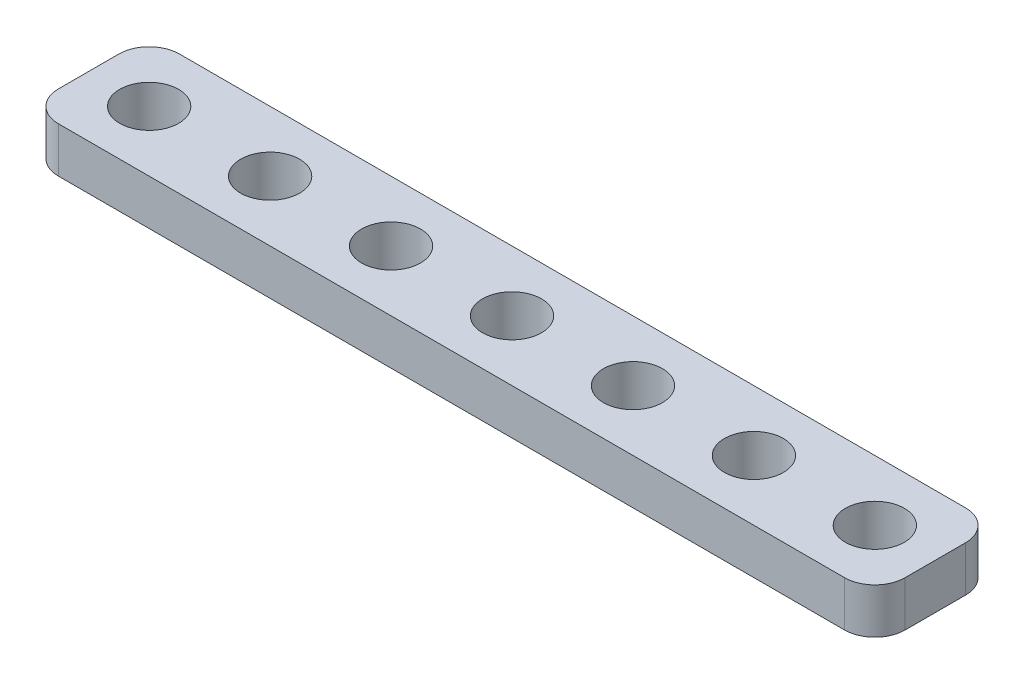
ISO-10303-21;
HEADER;
FILE_DESCRIPTION(('STEP AP214'),'2;1');
FILE_NAME('part.step','',(''),(''),'','','');
FILE_SCHEMA(('AUTOMOTIVE_DESIGN { 1 0 10303 214 1 1 1 1 }'));
ENDSEC;
DATA;
#1=APPLICATION_CONTEXT('core data for automotive mechanical design processes');
#2=APPLICATION_PROTOCOL_DEFINITION('international standard','automotive_design',2000,#1);
#3=PRODUCT_CONTEXT('',#1,'mechanical');
#4=PRODUCT('Part','Part','',(#3));
#5=PRODUCT_RELATED_PRODUCT_CATEGORY('part','',(#4));
#6=PRODUCT_DEFINITION_FORMATION('','',#4);
#7=PRODUCT_DEFINITION_CONTEXT('part definition',#1,'design');
#8=PRODUCT_DEFINITION('design','',#6,#7);
#9=PRODUCT_DEFINITION_SHAPE('','',#8);
#10=(LENGTH_UNIT() NAMED_UNIT(*) SI_UNIT(.MILLI.,.METRE.));
#11=(NAMED_UNIT(*) PLANE_ANGLE_UNIT() SI_UNIT($,.RADIAN.));
#12=(NAMED_UNIT(*) SI_UNIT($,.STERADIAN.) SOLID_ANGLE_UNIT());
#13=UNCERTAINTY_MEASURE_WITH_UNIT(LENGTH_MEASURE(1.E-05),#10,'distance_accuracy_value','');
#14=(GEOMETRIC_REPRESENTATION_CONTEXT(3) GLOBAL_UNCERTAINTY_ASSIGNED_CONTEXT((#13)) GLOBAL_UNIT_ASSIGNED_CONTEXT((#10,
#11,#12)) REPRESENTATION_CONTEXT('',''));
#15=CARTESIAN_POINT('',(0.,0.,0.));
#16=DIRECTION('',(0.,0.,1.));
#17=DIRECTION('',(1.,0.,0.));
#18=AXIS2_PLACEMENT_3D('',#15,#16,#17);
#19=CARTESIAN_POINT('',(54.,3.,6.));
#20=DIRECTION('',(0.,-1.,0.));
#21=DIRECTION('',(0.,0.,-1.));
#22=AXIS2_PLACEMENT_3D('',#19,#20,#21);
#23=CYLINDRICAL_SURFACE('',#22,2.);
#24=CARTESIAN_POINT('',(54.,0.,6.));
#25=DIRECTION('',(0.,1.,0.));
#26=DIRECTION('',(0.,0.,1.));
#27=AXIS2_PLACEMENT_3D('',#24,#25,#26);
#28=CIRCLE('',#27,2.);
#29=CARTESIAN_POINT('',(54.,0.,8.));
#30=VERTEX_POINT('',#29);
#31=CARTESIAN_POINT('',(56.,0.,6.));
#32=VERTEX_POINT('',#31);
#33=EDGE_CURVE('E128',#30,#32,#28,.T.);
#34=ORIENTED_EDGE('',*,*,#33,.T.);
#35=DIRECTION('',(0.,-1.,0.));
#36=VECTOR('',#35,1.);
#37=CARTESIAN_POINT('',(56.,3.,6.));
#38=LINE('',#37,#36);
#39=CARTESIAN_POINT('',(56.,3.,6.));
#40=VERTEX_POINT('',#39);
#41=EDGE_CURVE('E11',#40,#32,#38,.T.);
#42=ORIENTED_EDGE('',*,*,#41,.F.);
#43=CARTESIAN_POINT('',(54.,3.,6.));
#44=DIRECTION('',(0.,1.,0.));
#45=DIRECTION('',(0.,0.,1.));
#46=AXIS2_PLACEMENT_3D('',#43,#44,#45);
#47=CIRCLE('',#46,2.);
#48=CARTESIAN_POINT('',(54.,3.,8.));
#49=VERTEX_POINT('',#48);
#50=EDGE_CURVE('E143',#49,#40,#47,.T.);
#51=ORIENTED_EDGE('',*,*,#50,.F.);
#52=DIRECTION('',(0.,-1.,0.));
#53=VECTOR('',#52,1.);
#54=CARTESIAN_POINT('',(54.,3.,8.));
#55=LINE('',#54,#53);
#56=EDGE_CURVE('E124',#49,#30,#55,.T.);
#57=ORIENTED_EDGE('',*,*,#56,.T.);
#58=EDGE_LOOP('',(#34,#42,#51,#57));
#59=FACE_BOUND('',#58,.T.);
#60=ADVANCED_FACE('F32',(#59),#23,.T.);
#61=CARTESIAN_POINT('',(56.,3.,2.));
#62=DIRECTION('',(-1.,0.,0.));
#63=DIRECTION('',(0.,0.,1.));
#64=AXIS2_PLACEMENT_3D('',#61,#62,#63);
#65=PLANE('',#64);
#66=DIRECTION('',(0.,0.,-1.));
#67=VECTOR('',#66,1.);
#68=CARTESIAN_POINT('',(56.,0.,2.));
#69=LINE('',#68,#67);
#70=CARTESIAN_POINT('',(56.,0.,2.));
#71=VERTEX_POINT('',#70);
#72=EDGE_CURVE('E131',#32,#71,#69,.T.);
#73=ORIENTED_EDGE('',*,*,#72,.T.);
#74=DIRECTION('',(0.,-1.,0.));
#75=VECTOR('',#74,1.);
#76=CARTESIAN_POINT('',(56.,3.,2.));
#77=LINE('',#76,#75);
#78=CARTESIAN_POINT('',(56.,3.,2.));
#79=VERTEX_POINT('',#78);
#80=EDGE_CURVE('E40',#79,#71,#77,.T.);
#81=ORIENTED_EDGE('',*,*,#80,.F.);
#82=DIRECTION('',(0.,0.,-1.));
#83=VECTOR('',#82,1.);
#84=CARTESIAN_POINT('',(56.,3.,2.));
#85=LINE('',#84,#83);
#86=EDGE_CURVE('E91',#40,#79,#85,.T.);
#87=ORIENTED_EDGE('',*,*,#86,.F.);
#88=ORIENTED_EDGE('',*,*,#41,.T.);
#89=EDGE_LOOP('',(#73,#81,#87,#88));
#90=FACE_BOUND('',#89,.T.);
#91=ADVANCED_FACE('F259',(#90),#65,.F.);
#92=CARTESIAN_POINT('',(54.,3.,2.));
#93=DIRECTION('',(0.,-1.,0.));
#94=DIRECTION('',(0.,0.,-1.));
#95=AXIS2_PLACEMENT_3D('',#92,#93,#94);
#96=CYLINDRICAL_SURFACE('',#95,2.);
#97=CARTESIAN_POINT('',(54.,0.,2.));
#98=DIRECTION('',(0.,1.,0.));
#99=DIRECTION('',(0.,0.,-1.));
#100=AXIS2_PLACEMENT_3D('',#97,#98,#99);
#101=CIRCLE('',#100,2.);
#102=CARTESIAN_POINT('',(54.,0.,0.));
#103=VERTEX_POINT('',#102);
#104=EDGE_CURVE('E134',#71,#103,#101,.T.);
#105=ORIENTED_EDGE('',*,*,#104,.T.);
#106=DIRECTION('',(0.,-1.,0.));
#107=VECTOR('',#106,1.);
#108=CARTESIAN_POINT('',(54.,3.,0.));
#109=LINE('',#108,#107);
#110=CARTESIAN_POINT('',(54.,3.,0.));
#111=VERTEX_POINT('',#110);
#112=EDGE_CURVE('E150',#111,#103,#109,.T.);
#113=ORIENTED_EDGE('',*,*,#112,.F.);
#114=CARTESIAN_POINT('',(54.,3.,2.));
#115=DIRECTION('',(0.,1.,0.));
#116=DIRECTION('',(0.,0.,-1.));
#117=AXIS2_PLACEMENT_3D('',#114,#115,#116);
#118=CIRCLE('',#117,2.);
#119=EDGE_CURVE('E158',#79,#111,#118,.T.);
#120=ORIENTED_EDGE('',*,*,#119,.F.);
#121=ORIENTED_EDGE('',*,*,#80,.T.);
#122=EDGE_LOOP('',(#105,#113,#120,#121));
#123=FACE_BOUND('',#122,.T.);
#124=ADVANCED_FACE('F156',(#123),#96,.T.);
#125=CARTESIAN_POINT('',(2.00000000000001,3.,0.));
#126=DIRECTION('',(0.,0.,1.));
#127=DIRECTION('',(1.,0.,0.));
#128=AXIS2_PLACEMENT_3D('',#125,#126,#127);
#129=PLANE('',#128);
#130=DIRECTION('',(-1.,0.,0.));
#131=VECTOR('',#130,1.);
#132=CARTESIAN_POINT('',(2.00000000000001,0.,0.));
#133=LINE('',#132,#131);
#134=CARTESIAN_POINT('',(2.00000000000001,0.,0.));
#135=VERTEX_POINT('',#134);
#136=EDGE_CURVE('E136',#103,#135,#133,.T.);
#137=ORIENTED_EDGE('',*,*,#136,.T.);
#138=DIRECTION('',(0.,-1.,0.));
#139=VECTOR('',#138,1.);
#140=CARTESIAN_POINT('',(2.00000000000001,3.,0.));
#141=LINE('',#140,#139);
#142=CARTESIAN_POINT('',(2.00000000000001,3.,0.));
#143=VERTEX_POINT('',#142);
#144=EDGE_CURVE('E147',#143,#135,#141,.T.);
#145=ORIENTED_EDGE('',*,*,#144,.F.);
#146=DIRECTION('',(-1.,0.,0.));
#147=VECTOR('',#146,1.);
#148=CARTESIAN_POINT('',(2.00000000000001,3.,0.));
#149=LINE('',#148,#147);
#150=EDGE_CURVE('E170',#111,#143,#149,.T.);
#151=ORIENTED_EDGE('',*,*,#150,.F.);
#152=ORIENTED_EDGE('',*,*,#112,.T.);
#153=EDGE_LOOP('',(#137,#145,#151,#152));
#154=FACE_BOUND('',#153,.T.);
#155=ADVANCED_FACE('F166',(#154),#129,.F.);
#156=CARTESIAN_POINT('',(2.,3.,2.));
#157=DIRECTION('',(0.,-1.,0.));
#158=DIRECTION('',(0.,0.,-1.));
#159=AXIS2_PLACEMENT_3D('',#156,#157,#158);
#160=CYLINDRICAL_SURFACE('',#159,2.);
#161=CARTESIAN_POINT('',(2.,0.,2.));
#162=DIRECTION('',(0.,1.,0.));
#163=DIRECTION('',(0.,0.,1.));
#164=AXIS2_PLACEMENT_3D('',#161,#162,#163);
#165=CIRCLE('',#164,2.);
#166=CARTESIAN_POINT('',(0.,0.,2.00000000000001));
#167=VERTEX_POINT('',#166);
#168=EDGE_CURVE('E138',#135,#167,#165,.T.);
#169=ORIENTED_EDGE('',*,*,#168,.T.);
#170=DIRECTION('',(0.,-1.,0.));
#171=VECTOR('',#170,1.);
#172=CARTESIAN_POINT('',(0.,3.,2.00000000000001));
#173=LINE('',#172,#171);
#174=CARTESIAN_POINT('',(0.,3.,2.00000000000001));
#175=VERTEX_POINT('',#174);
#176=EDGE_CURVE('E119',#175,#167,#173,.T.);
#177=ORIENTED_EDGE('',*,*,#176,.F.);
#178=CARTESIAN_POINT('',(2.,3.,2.));
#179=DIRECTION('',(0.,1.,0.));
#180=DIRECTION('',(0.,0.,1.));
#181=AXIS2_PLACEMENT_3D('',#178,#179,#180);
#182=CIRCLE('',#181,2.);
#183=EDGE_CURVE('E110',#143,#175,#182,.T.);
#184=ORIENTED_EDGE('',*,*,#183,.F.);
#185=ORIENTED_EDGE('',*,*,#144,.T.);
#186=EDGE_LOOP('',(#169,#177,#184,#185));
#187=FACE_BOUND('',#186,.T.);
#188=ADVANCED_FACE('F169',(#187),#160,.T.);
#189=CARTESIAN_POINT('',(0.,3.,2.00000000000001));
#190=DIRECTION('',(1.,0.,0.));
#191=DIRECTION('',(0.,0.,-1.));
#192=AXIS2_PLACEMENT_3D('',#189,#190,#191);
#193=PLANE('',#192);
#194=DIRECTION('',(0.,0.,1.));
#195=VECTOR('',#194,1.);
#196=CARTESIAN_POINT('',(0.,0.,2.00000000000001));
#197=LINE('',#196,#195);
#198=CARTESIAN_POINT('',(0.,0.,6.));
#199=VERTEX_POINT('',#198);
#200=EDGE_CURVE('E118',#167,#199,#197,.T.);
#201=ORIENTED_EDGE('',*,*,#200,.T.);
#202=DIRECTION('',(0.,-1.,0.));
#203=VECTOR('',#202,1.);
#204=CARTESIAN_POINT('',(0.,3.,6.));
#205=LINE('',#204,#203);
#206=CARTESIAN_POINT('',(0.,3.,6.));
#207=VERTEX_POINT('',#206);
#208=EDGE_CURVE('E115',#207,#199,#205,.T.);
#209=ORIENTED_EDGE('',*,*,#208,.F.);
#210=DIRECTION('',(0.,0.,1.));
#211=VECTOR('',#210,1.);
#212=CARTESIAN_POINT('',(0.,3.,2.00000000000001));
#213=LINE('',#212,#211);
#214=EDGE_CURVE('E104',#175,#207,#213,.T.);
#215=ORIENTED_EDGE('',*,*,#214,.F.);
#216=ORIENTED_EDGE('',*,*,#176,.T.);
#217=EDGE_LOOP('',(#201,#209,#215,#216));
#218=FACE_BOUND('',#217,.T.);
#219=ADVANCED_FACE('F116',(#218),#193,.F.);
#220=CARTESIAN_POINT('',(2.,3.,6.));
#221=DIRECTION('',(0.,-1.,0.));
#222=DIRECTION('',(0.,0.,-1.));
#223=AXIS2_PLACEMENT_3D('',#220,#221,#222);
#224=CYLINDRICAL_SURFACE('',#223,2.);
#225=CARTESIAN_POINT('',(2.,0.,6.));
#226=DIRECTION('',(0.,1.,0.));
#227=DIRECTION('',(0.,0.,1.));
#228=AXIS2_PLACEMENT_3D('',#225,#226,#227);
#229=CIRCLE('',#228,2.);
#230=CARTESIAN_POINT('',(2.,0.,8.));
#231=VERTEX_POINT('',#230);
#232=EDGE_CURVE('E77',#199,#231,#229,.T.);
#233=ORIENTED_EDGE('',*,*,#232,.T.);
#234=DIRECTION('',(0.,-1.,0.));
#235=VECTOR('',#234,1.);
#236=CARTESIAN_POINT('',(2.,3.,8.));
#237=LINE('',#236,#235);
#238=CARTESIAN_POINT('',(2.,3.,8.));
#239=VERTEX_POINT('',#238);
#240=EDGE_CURVE('E120',#239,#231,#237,.T.);
#241=ORIENTED_EDGE('',*,*,#240,.F.);
#242=CARTESIAN_POINT('',(2.,3.,6.));
#243=DIRECTION('',(0.,1.,0.));
#244=DIRECTION('',(0.,0.,1.));
#245=AXIS2_PLACEMENT_3D('',#242,#243,#244);
#246=CIRCLE('',#245,2.);
#247=EDGE_CURVE('E108',#207,#239,#246,.T.);
#248=ORIENTED_EDGE('',*,*,#247,.F.);
#249=ORIENTED_EDGE('',*,*,#208,.T.);
#250=EDGE_LOOP('',(#233,#241,#248,#249));
#251=FACE_BOUND('',#250,.T.);
#252=ADVANCED_FACE('F122',(#251),#224,.T.);
#253=CARTESIAN_POINT('',(2.,3.,8.));
#254=DIRECTION('',(0.,0.,-1.));
#255=DIRECTION('',(-1.,0.,0.));
#256=AXIS2_PLACEMENT_3D('',#253,#254,#255);
#257=PLANE('',#256);
#258=DIRECTION('',(1.,0.,0.));
#259=VECTOR('',#258,1.);
#260=CARTESIAN_POINT('',(2.,0.,8.));
#261=LINE('',#260,#259);
#262=EDGE_CURVE('E83',#231,#30,#261,.T.);
#263=ORIENTED_EDGE('',*,*,#262,.T.);
#264=ORIENTED_EDGE('',*,*,#56,.F.);
#265=DIRECTION('',(1.,0.,0.));
#266=VECTOR('',#265,1.);
#267=CARTESIAN_POINT('',(2.,3.,8.));
#268=LINE('',#267,#266);
#269=EDGE_CURVE('E48',#239,#49,#268,.T.);
#270=ORIENTED_EDGE('',*,*,#269,.F.);
#271=ORIENTED_EDGE('',*,*,#240,.T.);
#272=EDGE_LOOP('',(#263,#264,#270,#271));
#273=FACE_BOUND('',#272,.T.);
#274=ADVANCED_FACE('F229',(#273),#257,.F.);
#275=CARTESIAN_POINT('',(54.,3.,6.));
#276=DIRECTION('',(0.,1.,0.));
#277=DIRECTION('',(0.,0.,1.));
#278=AXIS2_PLACEMENT_3D('',#275,#276,#277);
#279=PLANE('',#278);
#280=CARTESIAN_POINT('',(52.,3.,4.));
#281=DIRECTION('',(0.,1.,0.));
#282=DIRECTION('',(0.,0.,1.));
#283=AXIS2_PLACEMENT_3D('',#280,#281,#282);
#284=CIRCLE('',#283,1.95);
#285=CARTESIAN_POINT('',(52.,3.,5.95));
#286=VERTEX_POINT('',#285);
#287=EDGE_CURVE('E183',#286,#286,#284,.T.);
#288=ORIENTED_EDGE('',*,*,#287,.F.);
#289=EDGE_LOOP('',(#288));
#290=FACE_BOUND('',#289,.T.);
#291=CARTESIAN_POINT('',(36.,3.,4.));
#292=DIRECTION('',(0.,1.,0.));
#293=DIRECTION('',(0.,0.,1.));
#294=AXIS2_PLACEMENT_3D('',#291,#292,#293);
#295=CIRCLE('',#294,1.95);
#296=CARTESIAN_POINT('',(36.,3.,5.95));
#297=VERTEX_POINT('',#296);
#298=EDGE_CURVE('E190',#297,#297,#295,.T.);
#299=ORIENTED_EDGE('',*,*,#298,.F.);
#300=EDGE_LOOP('',(#299));
#301=FACE_BOUND('',#300,.T.);
#302=CARTESIAN_POINT('',(28.,3.,4.));
#303=DIRECTION('',(0.,1.,0.));
#304=DIRECTION('',(0.,0.,1.));
#305=AXIS2_PLACEMENT_3D('',#302,#303,#304);
#306=CIRCLE('',#305,1.95000000000001);
#307=CARTESIAN_POINT('',(28.,3.,5.95000000000002));
#308=VERTEX_POINT('',#307);
#309=EDGE_CURVE('E196',#308,#308,#306,.T.);
#310=ORIENTED_EDGE('',*,*,#309,.F.);
#311=EDGE_LOOP('',(#310));
#312=FACE_BOUND('',#311,.T.);
#313=CARTESIAN_POINT('',(20.,3.,4.));
#314=DIRECTION('',(0.,1.,0.));
#315=DIRECTION('',(0.,0.,1.));
#316=AXIS2_PLACEMENT_3D('',#313,#314,#315);
#317=CIRCLE('',#316,1.95);
#318=CARTESIAN_POINT('',(20.,3.,5.95));
#319=VERTEX_POINT('',#318);
#320=EDGE_CURVE('E202',#319,#319,#317,.T.);
#321=ORIENTED_EDGE('',*,*,#320,.F.);
#322=EDGE_LOOP('',(#321));
#323=FACE_BOUND('',#322,.T.);
#324=CARTESIAN_POINT('',(12.,3.,4.00000000000001));
#325=DIRECTION('',(0.,1.,0.));
#326=DIRECTION('',(0.,0.,1.));
#327=AXIS2_PLACEMENT_3D('',#324,#325,#326);
#328=CIRCLE('',#327,1.95);
#329=CARTESIAN_POINT('',(12.,3.,5.95));
#330=VERTEX_POINT('',#329);
#331=EDGE_CURVE('E208',#330,#330,#328,.T.);
#332=ORIENTED_EDGE('',*,*,#331,.F.);
#333=EDGE_LOOP('',(#332));
#334=FACE_BOUND('',#333,.T.);
#335=CARTESIAN_POINT('',(44.,3.,4.));
#336=DIRECTION('',(0.,1.,0.));
#337=DIRECTION('',(0.,0.,1.));
#338=AXIS2_PLACEMENT_3D('',#335,#336,#337);
#339=CIRCLE('',#338,1.95);
#340=CARTESIAN_POINT('',(44.,3.,5.95));
#341=VERTEX_POINT('',#340);
#342=EDGE_CURVE('E176',#341,#341,#339,.T.);
#343=ORIENTED_EDGE('',*,*,#342,.F.);
#344=EDGE_LOOP('',(#343));
#345=FACE_BOUND('',#344,.T.);
#346=CARTESIAN_POINT('',(4.,3.,4.00000000000001));
#347=DIRECTION('',(0.,1.,0.));
#348=DIRECTION('',(0.,0.,1.));
#349=AXIS2_PLACEMENT_3D('',#346,#347,#348);
#350=CIRCLE('',#349,1.95);
#351=CARTESIAN_POINT('',(4.,3.,5.95));
#352=VERTEX_POINT('',#351);
#353=EDGE_CURVE('E184',#352,#352,#350,.T.);
#354=ORIENTED_EDGE('',*,*,#353,.F.);
#355=EDGE_LOOP('',(#354));
#356=FACE_BOUND('',#355,.T.);
#357=ORIENTED_EDGE('',*,*,#50,.T.);
#358=ORIENTED_EDGE('',*,*,#86,.T.);
#359=ORIENTED_EDGE('',*,*,#119,.T.);
#360=ORIENTED_EDGE('',*,*,#150,.T.);
#361=ORIENTED_EDGE('',*,*,#183,.T.);
#362=ORIENTED_EDGE('',*,*,#214,.T.);
#363=ORIENTED_EDGE('',*,*,#247,.T.);
#364=ORIENTED_EDGE('',*,*,#269,.T.);
#365=EDGE_LOOP('',(#357,#358,#359,#360,#361,#362,#363,#364));
#366=FACE_BOUND('',#365,.T.);
#367=ADVANCED_FACE('F106',(#290,#301,#312,#323,#334,#345,#356,#366),#279,.T.);
#368=CARTESIAN_POINT('',(54.,0.,6.));
#369=DIRECTION('',(0.,1.,0.));
#370=DIRECTION('',(0.,0.,1.));
#371=AXIS2_PLACEMENT_3D('',#368,#369,#370);
#372=PLANE('',#371);
#373=CARTESIAN_POINT('',(52.,0.,4.));
#374=DIRECTION('',(0.,1.,0.));
#375=DIRECTION('',(0.,0.,1.));
#376=AXIS2_PLACEMENT_3D('',#373,#374,#375);
#377=CIRCLE('',#376,1.95);
#378=CARTESIAN_POINT('',(52.,0.,5.95));
#379=VERTEX_POINT('',#378);
#380=EDGE_CURVE('E132',#379,#379,#377,.T.);
#381=ORIENTED_EDGE('',*,*,#380,.T.);
#382=EDGE_LOOP('',(#381));
#383=FACE_BOUND('',#382,.T.);
#384=CARTESIAN_POINT('',(36.,0.,4.));
#385=DIRECTION('',(0.,1.,0.));
#386=DIRECTION('',(0.,0.,1.));
#387=AXIS2_PLACEMENT_3D('',#384,#385,#386);
#388=CIRCLE('',#387,1.95);
#389=CARTESIAN_POINT('',(36.,0.,5.95));
#390=VERTEX_POINT('',#389);
#391=EDGE_CURVE('E193',#390,#390,#388,.T.);
#392=ORIENTED_EDGE('',*,*,#391,.T.);
#393=EDGE_LOOP('',(#392));
#394=FACE_BOUND('',#393,.T.);
#395=CARTESIAN_POINT('',(28.,0.,4.));
#396=DIRECTION('',(0.,1.,0.));
#397=DIRECTION('',(0.,0.,1.));
#398=AXIS2_PLACEMENT_3D('',#395,#396,#397);
#399=CIRCLE('',#398,1.95000000000001);
#400=CARTESIAN_POINT('',(28.,0.,5.95000000000002));
#401=VERTEX_POINT('',#400);
#402=EDGE_CURVE('E199',#401,#401,#399,.T.);
#403=ORIENTED_EDGE('',*,*,#402,.T.);
#404=EDGE_LOOP('',(#403));
#405=FACE_BOUND('',#404,.T.);
#406=CARTESIAN_POINT('',(20.,0.,4.));
#407=DIRECTION('',(0.,1.,0.));
#408=DIRECTION('',(0.,0.,1.));
#409=AXIS2_PLACEMENT_3D('',#406,#407,#408);
#410=CIRCLE('',#409,1.95);
#411=CARTESIAN_POINT('',(20.,0.,5.95));
#412=VERTEX_POINT('',#411);
#413=EDGE_CURVE('E205',#412,#412,#410,.T.);
#414=ORIENTED_EDGE('',*,*,#413,.T.);
#415=EDGE_LOOP('',(#414));
#416=FACE_BOUND('',#415,.T.);
#417=CARTESIAN_POINT('',(12.,0.,4.00000000000001));
#418=DIRECTION('',(0.,1.,0.));
#419=DIRECTION('',(0.,0.,1.));
#420=AXIS2_PLACEMENT_3D('',#417,#418,#419);
#421=CIRCLE('',#420,1.95);
#422=CARTESIAN_POINT('',(12.,0.,5.95));
#423=VERTEX_POINT('',#422);
#424=EDGE_CURVE('E187',#423,#423,#421,.T.);
#425=ORIENTED_EDGE('',*,*,#424,.T.);
#426=EDGE_LOOP('',(#425));
#427=FACE_BOUND('',#426,.T.);
#428=CARTESIAN_POINT('',(44.,0.,4.));
#429=DIRECTION('',(0.,1.,0.));
#430=DIRECTION('',(0.,0.,1.));
#431=AXIS2_PLACEMENT_3D('',#428,#429,#430);
#432=CIRCLE('',#431,1.95);
#433=CARTESIAN_POINT('',(44.,0.,5.95));
#434=VERTEX_POINT('',#433);
#435=EDGE_CURVE('E179',#434,#434,#432,.T.);
#436=ORIENTED_EDGE('',*,*,#435,.T.);
#437=EDGE_LOOP('',(#436));
#438=FACE_BOUND('',#437,.T.);
#439=CARTESIAN_POINT('',(4.,0.,4.00000000000001));
#440=DIRECTION('',(0.,1.,0.));
#441=DIRECTION('',(0.,0.,1.));
#442=AXIS2_PLACEMENT_3D('',#439,#440,#441);
#443=CIRCLE('',#442,1.95);
#444=CARTESIAN_POINT('',(4.,0.,5.95));
#445=VERTEX_POINT('',#444);
#446=EDGE_CURVE('E180',#445,#445,#443,.T.);
#447=ORIENTED_EDGE('',*,*,#446,.T.);
#448=EDGE_LOOP('',(#447));
#449=FACE_BOUND('',#448,.T.);
#450=ORIENTED_EDGE('',*,*,#33,.F.);
#451=ORIENTED_EDGE('',*,*,#262,.F.);
#452=ORIENTED_EDGE('',*,*,#232,.F.);
#453=ORIENTED_EDGE('',*,*,#200,.F.);
#454=ORIENTED_EDGE('',*,*,#168,.F.);
#455=ORIENTED_EDGE('',*,*,#136,.F.);
#456=ORIENTED_EDGE('',*,*,#104,.F.);
#457=ORIENTED_EDGE('',*,*,#72,.F.);
#458=EDGE_LOOP('',(#450,#451,#452,#453,#454,#455,#456,#457));
#459=FACE_BOUND('',#458,.T.);
#460=ADVANCED_FACE('F162',(#383,#394,#405,#416,#427,#438,#449,#459),#372,.F.);
#461=CARTESIAN_POINT('',(4.,0.,4.00000000000001));
#462=DIRECTION('',(0.,1.,0.));
#463=DIRECTION('',(0.,0.,1.));
#464=AXIS2_PLACEMENT_3D('',#461,#462,#463);
#465=CYLINDRICAL_SURFACE('',#464,1.95);
#466=ORIENTED_EDGE('',*,*,#446,.F.);
#467=EDGE_LOOP('',(#466));
#468=FACE_BOUND('',#467,.T.);
#469=ORIENTED_EDGE('',*,*,#353,.T.);
#470=EDGE_LOOP('',(#469));
#471=FACE_BOUND('',#470,.T.);
#472=ADVANCED_FACE('F243',(#468,#471),#465,.F.);
#473=CARTESIAN_POINT('',(44.,0.,4.));
#474=DIRECTION('',(0.,1.,0.));
#475=DIRECTION('',(0.,0.,1.));
#476=AXIS2_PLACEMENT_3D('',#473,#474,#475);
#477=CYLINDRICAL_SURFACE('',#476,1.95);
#478=ORIENTED_EDGE('',*,*,#435,.F.);
#479=EDGE_LOOP('',(#478));
#480=FACE_BOUND('',#479,.T.);
#481=ORIENTED_EDGE('',*,*,#342,.T.);
#482=EDGE_LOOP('',(#481));
#483=FACE_BOUND('',#482,.T.);
#484=ADVANCED_FACE('F245',(#480,#483),#477,.F.);
#485=CARTESIAN_POINT('',(12.,0.,4.00000000000001));
#486=DIRECTION('',(0.,1.,0.));
#487=DIRECTION('',(0.,0.,1.));
#488=AXIS2_PLACEMENT_3D('',#485,#486,#487);
#489=CYLINDRICAL_SURFACE('',#488,1.95);
#490=ORIENTED_EDGE('',*,*,#424,.F.);
#491=EDGE_LOOP('',(#490));
#492=FACE_BOUND('',#491,.T.);
#493=ORIENTED_EDGE('',*,*,#331,.T.);
#494=EDGE_LOOP('',(#493));
#495=FACE_BOUND('',#494,.T.);
#496=ADVANCED_FACE('F252',(#492,#495),#489,.F.);
#497=CARTESIAN_POINT('',(20.,0.,4.));
#498=DIRECTION('',(0.,1.,0.));
#499=DIRECTION('',(0.,0.,1.));
#500=AXIS2_PLACEMENT_3D('',#497,#498,#499);
#501=CYLINDRICAL_SURFACE('',#500,1.95);
#502=ORIENTED_EDGE('',*,*,#413,.F.);
#503=EDGE_LOOP('',(#502));
#504=FACE_BOUND('',#503,.T.);
#505=ORIENTED_EDGE('',*,*,#320,.T.);
#506=EDGE_LOOP('',(#505));
#507=FACE_BOUND('',#506,.T.);
#508=ADVANCED_FACE('F335',(#504,#507),#501,.F.);
#509=CARTESIAN_POINT('',(28.,0.,4.));
#510=DIRECTION('',(0.,1.,0.));
#511=DIRECTION('',(0.,0.,1.));
#512=AXIS2_PLACEMENT_3D('',#509,#510,#511);
#513=CYLINDRICAL_SURFACE('',#512,1.95000000000001);
#514=ORIENTED_EDGE('',*,*,#402,.F.);
#515=EDGE_LOOP('',(#514));
#516=FACE_BOUND('',#515,.T.);
#517=ORIENTED_EDGE('',*,*,#309,.T.);
#518=EDGE_LOOP('',(#517));
#519=FACE_BOUND('',#518,.T.);
#520=ADVANCED_FACE('F345',(#516,#519),#513,.F.);
#521=CARTESIAN_POINT('',(36.,0.,4.));
#522=DIRECTION('',(0.,1.,0.));
#523=DIRECTION('',(0.,0.,1.));
#524=AXIS2_PLACEMENT_3D('',#521,#522,#523);
#525=CYLINDRICAL_SURFACE('',#524,1.95);
#526=ORIENTED_EDGE('',*,*,#391,.F.);
#527=EDGE_LOOP('',(#526));
#528=FACE_BOUND('',#527,.T.);
#529=ORIENTED_EDGE('',*,*,#298,.T.);
#530=EDGE_LOOP('',(#529));
#531=FACE_BOUND('',#530,.T.);
#532=ADVANCED_FACE('F223',(#528,#531),#525,.F.);
#533=CARTESIAN_POINT('',(52.,0.,4.));
#534=DIRECTION('',(0.,1.,0.));
#535=DIRECTION('',(0.,0.,1.));
#536=AXIS2_PLACEMENT_3D('',#533,#534,#535);
#537=CYLINDRICAL_SURFACE('',#536,1.95);
#538=ORIENTED_EDGE('',*,*,#380,.F.);
#539=EDGE_LOOP('',(#538));
#540=FACE_BOUND('',#539,.T.);
#541=ORIENTED_EDGE('',*,*,#287,.T.);
#542=EDGE_LOOP('',(#541));
#543=FACE_BOUND('',#542,.T.);
#544=ADVANCED_FACE('F220',(#540,#543),#537,.F.);
#545=CLOSED_SHELL('',(#60,#91,#124,#155,#188,#219,#252,#274,#367,#460,#472,#484,#496,#508,#520,
#532,#544));
#546=MANIFOLD_SOLID_BREP('B2',#545);
#547=ADVANCED_BREP_SHAPE_REPRESENTATION('',(#18,#546),#14);
#548=SHAPE_DEFINITION_REPRESENTATION(#9,#547);
ENDSEC;
END-ISO-10303-21;
